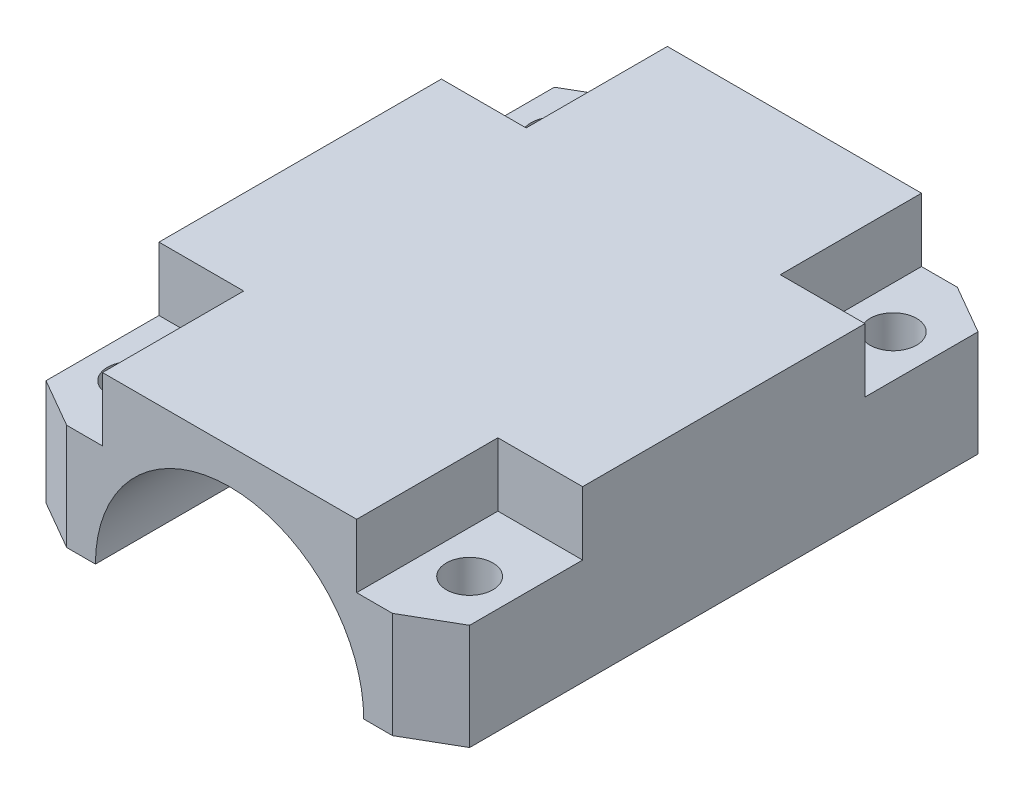
ISO-10303-21;
HEADER;
FILE_DESCRIPTION(('STEP AP214'),'2;1');
FILE_NAME('part.step','',(''),(''),'','','');
FILE_SCHEMA(('AUTOMOTIVE_DESIGN { 1 0 10303 214 1 1 1 1 }'));
ENDSEC;
DATA;
#1=APPLICATION_CONTEXT('core data for automotive mechanical design processes');
#2=APPLICATION_PROTOCOL_DEFINITION('international standard','automotive_design',2000,#1);
#3=PRODUCT_CONTEXT('',#1,'mechanical');
#4=PRODUCT('Part','Part','',(#3));
#5=PRODUCT_RELATED_PRODUCT_CATEGORY('part','',(#4));
#6=PRODUCT_DEFINITION_FORMATION('','',#4);
#7=PRODUCT_DEFINITION_CONTEXT('part definition',#1,'design');
#8=PRODUCT_DEFINITION('design','',#6,#7);
#9=PRODUCT_DEFINITION_SHAPE('','',#8);
#10=(LENGTH_UNIT() NAMED_UNIT(*) SI_UNIT(.MILLI.,.METRE.));
#11=(NAMED_UNIT(*) PLANE_ANGLE_UNIT() SI_UNIT($,.RADIAN.));
#12=(NAMED_UNIT(*) SI_UNIT($,.STERADIAN.) SOLID_ANGLE_UNIT());
#13=UNCERTAINTY_MEASURE_WITH_UNIT(LENGTH_MEASURE(1.E-05),#10,'distance_accuracy_value','');
#14=(GEOMETRIC_REPRESENTATION_CONTEXT(3) GLOBAL_UNCERTAINTY_ASSIGNED_CONTEXT((#13)) GLOBAL_UNIT_ASSIGNED_CONTEXT((#10,
#11,#12)) REPRESENTATION_CONTEXT('',''));
#15=CARTESIAN_POINT('',(0.,0.,0.));
#16=DIRECTION('',(0.,0.,1.));
#17=DIRECTION('',(1.,0.,0.));
#18=AXIS2_PLACEMENT_3D('',#15,#16,#17);
#19=CARTESIAN_POINT('',(-27.,12.,-35.));
#20=DIRECTION('',(0.,-1.,0.));
#21=DIRECTION('',(0.,0.,-1.));
#22=AXIS2_PLACEMENT_3D('',#19,#20,#21);
#23=CYLINDRICAL_SURFACE('',#22,1.65);
#24=CARTESIAN_POINT('',(-27.,0.,-35.));
#25=DIRECTION('',(0.,-1.,0.));
#26=DIRECTION('',(0.,0.,-1.));
#27=AXIS2_PLACEMENT_3D('',#24,#25,#26);
#28=CIRCLE('',#27,1.65);
#29=CARTESIAN_POINT('',(-27.,0.,-36.65));
#30=VERTEX_POINT('',#29);
#31=EDGE_CURVE('E332',#30,#30,#28,.T.);
#32=ORIENTED_EDGE('',*,*,#31,.T.);
#33=EDGE_LOOP('',(#32));
#34=FACE_BOUND('',#33,.T.);
#35=CARTESIAN_POINT('',(-27.,7.5,-35.));
#36=DIRECTION('',(0.,1.,0.));
#37=DIRECTION('',(0.,0.,1.));
#38=AXIS2_PLACEMENT_3D('',#35,#36,#37);
#39=CIRCLE('',#38,1.65);
#40=CARTESIAN_POINT('',(-27.,7.5,-33.35));
#41=VERTEX_POINT('',#40);
#42=EDGE_CURVE('E322',#41,#41,#39,.F.);
#43=ORIENTED_EDGE('',*,*,#42,.F.);
#44=EDGE_LOOP('',(#43));
#45=FACE_BOUND('',#44,.T.);
#46=ADVANCED_FACE('F32',(#34,#45),#23,.F.);
#47=CARTESIAN_POINT('',(-3.,12.,-35.));
#48=DIRECTION('',(0.,-1.,0.));
#49=DIRECTION('',(0.,0.,-1.));
#50=AXIS2_PLACEMENT_3D('',#47,#48,#49);
#51=CYLINDRICAL_SURFACE('',#50,1.65);
#52=CARTESIAN_POINT('',(-3.,0.,-35.));
#53=DIRECTION('',(0.,-1.,0.));
#54=DIRECTION('',(0.,0.,-1.));
#55=AXIS2_PLACEMENT_3D('',#52,#53,#54);
#56=CIRCLE('',#55,1.65);
#57=CARTESIAN_POINT('',(-3.,0.,-36.65));
#58=VERTEX_POINT('',#57);
#59=EDGE_CURVE('E328',#58,#58,#56,.T.);
#60=ORIENTED_EDGE('',*,*,#59,.T.);
#61=EDGE_LOOP('',(#60));
#62=FACE_BOUND('',#61,.T.);
#63=CARTESIAN_POINT('',(-3.,7.5,-35.));
#64=DIRECTION('',(0.,1.,0.));
#65=DIRECTION('',(0.,0.,1.));
#66=AXIS2_PLACEMENT_3D('',#63,#64,#65);
#67=CIRCLE('',#66,1.65);
#68=CARTESIAN_POINT('',(-3.,7.5,-33.35));
#69=VERTEX_POINT('',#68);
#70=EDGE_CURVE('E319',#69,#69,#67,.F.);
#71=ORIENTED_EDGE('',*,*,#70,.F.);
#72=EDGE_LOOP('',(#71));
#73=FACE_BOUND('',#72,.T.);
#74=ADVANCED_FACE('F447',(#62,#73),#51,.F.);
#75=CARTESIAN_POINT('',(-27.,12.,-4.99999999999997));
#76=DIRECTION('',(0.,-1.,0.));
#77=DIRECTION('',(0.,0.,-1.));
#78=AXIS2_PLACEMENT_3D('',#75,#76,#77);
#79=CYLINDRICAL_SURFACE('',#78,1.65);
#80=CARTESIAN_POINT('',(-27.,0.,-4.99999999999997));
#81=DIRECTION('',(0.,-1.,0.));
#82=DIRECTION('',(0.,0.,-1.));
#83=AXIS2_PLACEMENT_3D('',#80,#81,#82);
#84=CIRCLE('',#83,1.65);
#85=CARTESIAN_POINT('',(-27.,0.,-6.64999999999997));
#86=VERTEX_POINT('',#85);
#87=EDGE_CURVE('E329',#86,#86,#84,.T.);
#88=ORIENTED_EDGE('',*,*,#87,.T.);
#89=EDGE_LOOP('',(#88));
#90=FACE_BOUND('',#89,.T.);
#91=CARTESIAN_POINT('',(-27.,7.5,-4.99999999999997));
#92=DIRECTION('',(0.,1.,0.));
#93=DIRECTION('',(0.,0.,1.));
#94=AXIS2_PLACEMENT_3D('',#91,#92,#93);
#95=CIRCLE('',#94,1.65);
#96=CARTESIAN_POINT('',(-27.,7.5,-3.34999999999997));
#97=VERTEX_POINT('',#96);
#98=EDGE_CURVE('E316',#97,#97,#95,.F.);
#99=ORIENTED_EDGE('',*,*,#98,.F.);
#100=EDGE_LOOP('',(#99));
#101=FACE_BOUND('',#100,.T.);
#102=ADVANCED_FACE('F452',(#90,#101),#79,.F.);
#103=CARTESIAN_POINT('',(-30.,12.,-38.));
#104=DIRECTION('',(0.500000000000001,0.,0.866025403784438));
#105=DIRECTION('',(0.,-1.,0.));
#106=AXIS2_PLACEMENT_3D('',#103,#104,#105);
#107=PLANE('',#106);
#108=DIRECTION('',(0.,-1.,0.));
#109=VECTOR('',#108,1.);
#110=CARTESIAN_POINT('',(-30.,12.,-38.));
#111=LINE('',#110,#109);
#112=CARTESIAN_POINT('',(-30.,7.5,-38.));
#113=VERTEX_POINT('',#112);
#114=CARTESIAN_POINT('',(-30.,0.,-38.));
#115=VERTEX_POINT('',#114);
#116=EDGE_CURVE('E214',#113,#115,#111,.T.);
#117=ORIENTED_EDGE('',*,*,#116,.F.);
#118=DIRECTION('',(-0.866025403784438,0.,0.500000000000001));
#119=VECTOR('',#118,1.);
#120=CARTESIAN_POINT('',(-26.5358983848623,7.5,-40.));
#121=LINE('',#120,#119);
#122=CARTESIAN_POINT('',(-26.5358983848623,7.5,-40.));
#123=VERTEX_POINT('',#122);
#124=EDGE_CURVE('E363',#123,#113,#121,.T.);
#125=ORIENTED_EDGE('',*,*,#124,.F.);
#126=DIRECTION('',(0.,1.,0.));
#127=VECTOR('',#126,1.);
#128=CARTESIAN_POINT('',(-26.5358983848623,12.,-40.));
#129=LINE('',#128,#127);
#130=CARTESIAN_POINT('',(-26.5358983848623,0.,-40.));
#131=VERTEX_POINT('',#130);
#132=EDGE_CURVE('E243',#131,#123,#129,.T.);
#133=ORIENTED_EDGE('',*,*,#132,.F.);
#134=DIRECTION('',(-0.866025403784438,0.,0.500000000000001));
#135=VECTOR('',#134,1.);
#136=CARTESIAN_POINT('',(-30.,0.,-38.));
#137=LINE('',#136,#135);
#138=EDGE_CURVE('E213',#115,#131,#137,.F.);
#139=ORIENTED_EDGE('',*,*,#138,.F.);
#140=EDGE_LOOP('',(#117,#125,#133,#139));
#141=FACE_BOUND('',#140,.T.);
#142=ADVANCED_FACE('F362',(#141),#107,.F.);
#143=CARTESIAN_POINT('',(-3.46410161513775,12.,-40.));
#144=DIRECTION('',(-0.500000000000001,0.,0.866025403784438));
#145=DIRECTION('',(0.,-1.,0.));
#146=AXIS2_PLACEMENT_3D('',#143,#144,#145);
#147=PLANE('',#146);
#148=DIRECTION('',(0.,-1.,0.));
#149=VECTOR('',#148,1.);
#150=CARTESIAN_POINT('',(-3.46410161513775,12.,-40.));
#151=LINE('',#150,#149);
#152=CARTESIAN_POINT('',(-3.46410161513775,7.5,-40.));
#153=VERTEX_POINT('',#152);
#154=CARTESIAN_POINT('',(-3.46410161513775,0.,-40.));
#155=VERTEX_POINT('',#154);
#156=EDGE_CURVE('E241',#153,#155,#151,.T.);
#157=ORIENTED_EDGE('',*,*,#156,.F.);
#158=DIRECTION('',(-0.866025403784438,0.,-0.500000000000001));
#159=VECTOR('',#158,1.);
#160=CARTESIAN_POINT('',(0.,7.5,-38.));
#161=LINE('',#160,#159);
#162=CARTESIAN_POINT('',(0.,7.5,-38.));
#163=VERTEX_POINT('',#162);
#164=EDGE_CURVE('E299',#163,#153,#161,.T.);
#165=ORIENTED_EDGE('',*,*,#164,.F.);
#166=DIRECTION('',(0.,1.,0.));
#167=VECTOR('',#166,1.);
#168=CARTESIAN_POINT('',(0.,12.,-38.));
#169=LINE('',#168,#167);
#170=CARTESIAN_POINT('',(0.,0.,-38.));
#171=VERTEX_POINT('',#170);
#172=EDGE_CURVE('E252',#171,#163,#169,.T.);
#173=ORIENTED_EDGE('',*,*,#172,.F.);
#174=DIRECTION('',(-0.866025403784438,0.,-0.500000000000001));
#175=VECTOR('',#174,1.);
#176=CARTESIAN_POINT('',(-3.46410161513775,0.,-40.));
#177=LINE('',#176,#175);
#178=EDGE_CURVE('E248',#155,#171,#177,.F.);
#179=ORIENTED_EDGE('',*,*,#178,.F.);
#180=EDGE_LOOP('',(#157,#165,#173,#179));
#181=FACE_BOUND('',#180,.T.);
#182=ADVANCED_FACE('F428',(#181),#147,.F.);
#183=CARTESIAN_POINT('',(-26.5358983848623,12.,0.));
#184=DIRECTION('',(0.5,0.,-0.866025403784438));
#185=DIRECTION('',(0.,-1.,0.));
#186=AXIS2_PLACEMENT_3D('',#183,#184,#185);
#187=PLANE('',#186);
#188=DIRECTION('',(0.,-1.,0.));
#189=VECTOR('',#188,1.);
#190=CARTESIAN_POINT('',(-26.5358983848623,12.,0.));
#191=LINE('',#190,#189);
#192=CARTESIAN_POINT('',(-26.5358983848623,7.5,0.));
#193=VERTEX_POINT('',#192);
#194=CARTESIAN_POINT('',(-26.5358983848623,0.,0.));
#195=VERTEX_POINT('',#194);
#196=EDGE_CURVE('E11',#193,#195,#191,.T.);
#197=ORIENTED_EDGE('',*,*,#196,.F.);
#198=DIRECTION('',(0.866025403784438,0.,0.5));
#199=VECTOR('',#198,1.);
#200=CARTESIAN_POINT('',(-30.,7.5,-1.99999999999999));
#201=LINE('',#200,#199);
#202=CARTESIAN_POINT('',(-30.,7.5,-1.99999999999999));
#203=VERTEX_POINT('',#202);
#204=EDGE_CURVE('E182',#203,#193,#201,.T.);
#205=ORIENTED_EDGE('',*,*,#204,.F.);
#206=DIRECTION('',(0.,1.,0.));
#207=VECTOR('',#206,1.);
#208=CARTESIAN_POINT('',(-30.,12.,-1.99999999999999));
#209=LINE('',#208,#207);
#210=CARTESIAN_POINT('',(-30.,0.,-1.99999999999999));
#211=VERTEX_POINT('',#210);
#212=EDGE_CURVE('E209',#211,#203,#209,.T.);
#213=ORIENTED_EDGE('',*,*,#212,.F.);
#214=DIRECTION('',(0.866025403784439,0.,0.5));
#215=VECTOR('',#214,1.);
#216=CARTESIAN_POINT('',(-26.5358983848623,0.,0.));
#217=LINE('',#216,#215);
#218=EDGE_CURVE('E207',#195,#211,#217,.F.);
#219=ORIENTED_EDGE('',*,*,#218,.F.);
#220=EDGE_LOOP('',(#197,#205,#213,#219));
#221=FACE_BOUND('',#220,.T.);
#222=ADVANCED_FACE('F206',(#221),#187,.F.);
#223=CARTESIAN_POINT('',(0.,0.,0.));
#224=DIRECTION('',(0.,1.,0.));
#225=DIRECTION('',(0.,0.,1.));
#226=AXIS2_PLACEMENT_3D('',#223,#224,#225);
#227=PLANE('',#226);
#228=ORIENTED_EDGE('',*,*,#59,.F.);
#229=EDGE_LOOP('',(#228));
#230=FACE_BOUND('',#229,.T.);
#231=CARTESIAN_POINT('',(-3.,0.,-4.99999999999997));
#232=DIRECTION('',(0.,-1.,0.));
#233=DIRECTION('',(0.,0.,-1.));
#234=AXIS2_PLACEMENT_3D('',#231,#232,#233);
#235=CIRCLE('',#234,1.65);
#236=CARTESIAN_POINT('',(-3.,0.,-6.64999999999997));
#237=VERTEX_POINT('',#236);
#238=EDGE_CURVE('E325',#237,#237,#235,.T.);
#239=ORIENTED_EDGE('',*,*,#238,.F.);
#240=EDGE_LOOP('',(#239));
#241=FACE_BOUND('',#240,.T.);
#242=DIRECTION('',(-1.,0.,0.));
#243=VECTOR('',#242,1.);
#244=CARTESIAN_POINT('',(0.,0.,-40.));
#245=LINE('',#244,#243);
#246=CARTESIAN_POINT('',(-5.5,0.,-40.));
#247=VERTEX_POINT('',#246);
#248=EDGE_CURVE('E352',#155,#247,#245,.T.);
#249=ORIENTED_EDGE('',*,*,#248,.F.);
#250=ORIENTED_EDGE('',*,*,#178,.T.);
#251=DIRECTION('',(0.,0.,-1.));
#252=VECTOR('',#251,1.);
#253=CARTESIAN_POINT('',(0.,0.,0.));
#254=LINE('',#253,#252);
#255=CARTESIAN_POINT('',(0.,0.,-2.));
#256=VERTEX_POINT('',#255);
#257=EDGE_CURVE('E341',#256,#171,#254,.T.);
#258=ORIENTED_EDGE('',*,*,#257,.F.);
#259=DIRECTION('',(0.866025403784438,0.,-0.500000000000001));
#260=VECTOR('',#259,1.);
#261=CARTESIAN_POINT('',(0.,0.,-2.));
#262=LINE('',#261,#260);
#263=CARTESIAN_POINT('',(-3.46410161513775,0.,0.));
#264=VERTEX_POINT('',#263);
#265=EDGE_CURVE('E246',#256,#264,#262,.F.);
#266=ORIENTED_EDGE('',*,*,#265,.T.);
#267=DIRECTION('',(1.,0.,0.));
#268=VECTOR('',#267,1.);
#269=CARTESIAN_POINT('',(0.,0.,0.));
#270=LINE('',#269,#268);
#271=CARTESIAN_POINT('',(-5.5,0.,0.));
#272=VERTEX_POINT('',#271);
#273=EDGE_CURVE('E224',#272,#264,#270,.T.);
#274=ORIENTED_EDGE('',*,*,#273,.F.);
#275=DIRECTION('',(0.,0.,-1.));
#276=VECTOR('',#275,1.);
#277=CARTESIAN_POINT('',(-5.5,0.,-40.));
#278=LINE('',#277,#276);
#279=EDGE_CURVE('E235',#247,#272,#278,.F.);
#280=ORIENTED_EDGE('',*,*,#279,.F.);
#281=EDGE_LOOP('',(#249,#250,#258,#266,#274,#280));
#282=FACE_BOUND('',#281,.T.);
#283=ADVANCED_FACE('F432',(#230,#241,#282),#227,.F.);
#284=ORIENTED_EDGE('',*,*,#87,.F.);
#285=EDGE_LOOP('',(#284));
#286=FACE_BOUND('',#285,.T.);
#287=ORIENTED_EDGE('',*,*,#31,.F.);
#288=EDGE_LOOP('',(#287));
#289=FACE_BOUND('',#288,.T.);
#290=DIRECTION('',(0.,0.,1.));
#291=VECTOR('',#290,1.);
#292=CARTESIAN_POINT('',(-30.,0.,0.));
#293=LINE('',#292,#291);
#294=EDGE_CURVE('E230',#115,#211,#293,.T.);
#295=ORIENTED_EDGE('',*,*,#294,.F.);
#296=ORIENTED_EDGE('',*,*,#138,.T.);
#297=CARTESIAN_POINT('',(-24.5,0.,-40.));
#298=VERTEX_POINT('',#297);
#299=EDGE_CURVE('E351',#298,#131,#245,.T.);
#300=ORIENTED_EDGE('',*,*,#299,.F.);
#301=DIRECTION('',(0.,0.,-1.));
#302=VECTOR('',#301,1.);
#303=CARTESIAN_POINT('',(-24.5,0.,-40.));
#304=LINE('',#303,#302);
#305=CARTESIAN_POINT('',(-24.5,0.,0.));
#306=VERTEX_POINT('',#305);
#307=EDGE_CURVE('E220',#306,#298,#304,.T.);
#308=ORIENTED_EDGE('',*,*,#307,.F.);
#309=EDGE_CURVE('E217',#195,#306,#270,.T.);
#310=ORIENTED_EDGE('',*,*,#309,.F.);
#311=ORIENTED_EDGE('',*,*,#218,.T.);
#312=EDGE_LOOP('',(#295,#296,#300,#308,#310,#311));
#313=FACE_BOUND('',#312,.T.);
#314=ADVANCED_FACE('F218',(#286,#289,#313),#227,.F.);
#315=CARTESIAN_POINT('',(0.,12.,0.));
#316=DIRECTION('',(-1.,0.,0.));
#317=DIRECTION('',(0.,0.,1.));
#318=AXIS2_PLACEMENT_3D('',#315,#316,#317);
#319=PLANE('',#318);
#320=DIRECTION('',(0.,0.,-1.));
#321=VECTOR('',#320,1.);
#322=CARTESIAN_POINT('',(0.,12.,0.));
#323=LINE('',#322,#321);
#324=CARTESIAN_POINT('',(0.,12.,-10.));
#325=VERTEX_POINT('',#324);
#326=CARTESIAN_POINT('',(0.,12.,-30.));
#327=VERTEX_POINT('',#326);
#328=EDGE_CURVE('E223',#325,#327,#323,.T.);
#329=ORIENTED_EDGE('',*,*,#328,.F.);
#330=DIRECTION('',(0.,1.,0.));
#331=VECTOR('',#330,1.);
#332=CARTESIAN_POINT('',(0.,7.5,-10.));
#333=LINE('',#332,#331);
#334=CARTESIAN_POINT('',(0.,7.5,-10.));
#335=VERTEX_POINT('',#334);
#336=EDGE_CURVE('E283',#335,#325,#333,.T.);
#337=ORIENTED_EDGE('',*,*,#336,.F.);
#338=DIRECTION('',(0.,0.,-1.));
#339=VECTOR('',#338,1.);
#340=CARTESIAN_POINT('',(0.,7.5,-10.));
#341=LINE('',#340,#339);
#342=CARTESIAN_POINT('',(0.,7.5,-2.));
#343=VERTEX_POINT('',#342);
#344=EDGE_CURVE('E268',#343,#335,#341,.T.);
#345=ORIENTED_EDGE('',*,*,#344,.F.);
#346=DIRECTION('',(0.,-1.,0.));
#347=VECTOR('',#346,1.);
#348=CARTESIAN_POINT('',(0.,12.,-2.));
#349=LINE('',#348,#347);
#350=EDGE_CURVE('E250',#343,#256,#349,.T.);
#351=ORIENTED_EDGE('',*,*,#350,.T.);
#352=ORIENTED_EDGE('',*,*,#257,.T.);
#353=ORIENTED_EDGE('',*,*,#172,.T.);
#354=DIRECTION('',(0.,0.,-1.));
#355=VECTOR('',#354,1.);
#356=CARTESIAN_POINT('',(0.,7.5,-30.));
#357=LINE('',#356,#355);
#358=CARTESIAN_POINT('',(0.,7.5,-30.));
#359=VERTEX_POINT('',#358);
#360=EDGE_CURVE('E55',#359,#163,#357,.T.);
#361=ORIENTED_EDGE('',*,*,#360,.F.);
#362=DIRECTION('',(0.,1.,0.));
#363=VECTOR('',#362,1.);
#364=CARTESIAN_POINT('',(0.,7.5,-30.));
#365=LINE('',#364,#363);
#366=EDGE_CURVE('E307',#359,#327,#365,.T.);
#367=ORIENTED_EDGE('',*,*,#366,.T.);
#368=EDGE_LOOP('',(#329,#337,#345,#351,#352,#353,#361,#367));
#369=FACE_BOUND('',#368,.T.);
#370=ADVANCED_FACE('F629',(#369),#319,.F.);
#371=CARTESIAN_POINT('',(0.,12.,-40.));
#372=DIRECTION('',(0.,0.,1.));
#373=DIRECTION('',(1.,0.,0.));
#374=AXIS2_PLACEMENT_3D('',#371,#372,#373);
#375=PLANE('',#374);
#376=DIRECTION('',(-1.,0.,0.));
#377=VECTOR('',#376,1.);
#378=CARTESIAN_POINT('',(-24.,7.5,-40.));
#379=LINE('',#378,#377);
#380=CARTESIAN_POINT('',(-24.,7.5,-40.));
#381=VERTEX_POINT('',#380);
#382=EDGE_CURVE('E47',#381,#123,#379,.T.);
#383=ORIENTED_EDGE('',*,*,#382,.F.);
#384=DIRECTION('',(0.,1.,0.));
#385=VECTOR('',#384,1.);
#386=CARTESIAN_POINT('',(-24.,7.5,-40.));
#387=LINE('',#386,#385);
#388=CARTESIAN_POINT('',(-24.,12.,-40.));
#389=VERTEX_POINT('',#388);
#390=EDGE_CURVE('E375',#381,#389,#387,.T.);
#391=ORIENTED_EDGE('',*,*,#390,.T.);
#392=DIRECTION('',(-1.,0.,0.));
#393=VECTOR('',#392,1.);
#394=CARTESIAN_POINT('',(0.,12.,-40.));
#395=LINE('',#394,#393);
#396=CARTESIAN_POINT('',(-6.,12.,-40.));
#397=VERTEX_POINT('',#396);
#398=EDGE_CURVE('E227',#397,#389,#395,.T.);
#399=ORIENTED_EDGE('',*,*,#398,.F.);
#400=DIRECTION('',(0.,1.,0.));
#401=VECTOR('',#400,1.);
#402=CARTESIAN_POINT('',(-6.,7.5,-40.));
#403=LINE('',#402,#401);
#404=CARTESIAN_POINT('',(-6.,7.5,-40.));
#405=VERTEX_POINT('',#404);
#406=EDGE_CURVE('E301',#405,#397,#403,.T.);
#407=ORIENTED_EDGE('',*,*,#406,.F.);
#408=DIRECTION('',(-1.,0.,0.));
#409=VECTOR('',#408,1.);
#410=CARTESIAN_POINT('',(-3.46410161513775,7.5,-40.));
#411=LINE('',#410,#409);
#412=EDGE_CURVE('E289',#153,#405,#411,.T.);
#413=ORIENTED_EDGE('',*,*,#412,.F.);
#414=ORIENTED_EDGE('',*,*,#156,.T.);
#415=ORIENTED_EDGE('',*,*,#248,.T.);
#416=CARTESIAN_POINT('',(-15.,0.,-40.));
#417=DIRECTION('',(0.,0.,-1.));
#418=DIRECTION('',(-1.,0.,0.));
#419=AXIS2_PLACEMENT_3D('',#416,#417,#418);
#420=CIRCLE('',#419,9.5);
#421=EDGE_CURVE('E337',#298,#247,#420,.T.);
#422=ORIENTED_EDGE('',*,*,#421,.F.);
#423=ORIENTED_EDGE('',*,*,#299,.T.);
#424=ORIENTED_EDGE('',*,*,#132,.T.);
#425=EDGE_LOOP('',(#383,#391,#399,#407,#413,#414,#415,#422,#423,#424));
#426=FACE_BOUND('',#425,.T.);
#427=ADVANCED_FACE('F358',(#426),#375,.F.);
#428=CARTESIAN_POINT('',(-30.,12.,0.));
#429=DIRECTION('',(1.,0.,0.));
#430=DIRECTION('',(0.,0.,-1.));
#431=AXIS2_PLACEMENT_3D('',#428,#429,#430);
#432=PLANE('',#431);
#433=DIRECTION('',(0.,0.,1.));
#434=VECTOR('',#433,1.);
#435=CARTESIAN_POINT('',(-30.,12.,0.));
#436=LINE('',#435,#434);
#437=CARTESIAN_POINT('',(-30.,12.,-30.));
#438=VERTEX_POINT('',#437);
#439=CARTESIAN_POINT('',(-30.,12.,-10.));
#440=VERTEX_POINT('',#439);
#441=EDGE_CURVE('E345',#438,#440,#436,.T.);
#442=ORIENTED_EDGE('',*,*,#441,.F.);
#443=DIRECTION('',(0.,1.,0.));
#444=VECTOR('',#443,1.);
#445=CARTESIAN_POINT('',(-30.,7.5,-30.));
#446=LINE('',#445,#444);
#447=CARTESIAN_POINT('',(-30.,7.5,-30.));
#448=VERTEX_POINT('',#447);
#449=EDGE_CURVE('E381',#448,#438,#446,.T.);
#450=ORIENTED_EDGE('',*,*,#449,.F.);
#451=DIRECTION('',(0.,0.,1.));
#452=VECTOR('',#451,1.);
#453=CARTESIAN_POINT('',(-30.,7.5,-38.));
#454=LINE('',#453,#452);
#455=EDGE_CURVE('E365',#113,#448,#454,.T.);
#456=ORIENTED_EDGE('',*,*,#455,.F.);
#457=ORIENTED_EDGE('',*,*,#116,.T.);
#458=ORIENTED_EDGE('',*,*,#294,.T.);
#459=ORIENTED_EDGE('',*,*,#212,.T.);
#460=DIRECTION('',(0.,0.,1.));
#461=VECTOR('',#460,1.);
#462=CARTESIAN_POINT('',(-30.,7.5,-10.));
#463=LINE('',#462,#461);
#464=CARTESIAN_POINT('',(-30.,7.5,-10.));
#465=VERTEX_POINT('',#464);
#466=EDGE_CURVE('E191',#465,#203,#463,.T.);
#467=ORIENTED_EDGE('',*,*,#466,.F.);
#468=DIRECTION('',(0.,1.,0.));
#469=VECTOR('',#468,1.);
#470=CARTESIAN_POINT('',(-30.,7.5,-10.));
#471=LINE('',#470,#469);
#472=EDGE_CURVE('E280',#465,#440,#471,.T.);
#473=ORIENTED_EDGE('',*,*,#472,.T.);
#474=EDGE_LOOP('',(#442,#450,#456,#457,#458,#459,#467,#473));
#475=FACE_BOUND('',#474,.T.);
#476=ADVANCED_FACE('F641',(#475),#432,.F.);
#477=CARTESIAN_POINT('',(0.,12.,0.));
#478=DIRECTION('',(0.,0.,-1.));
#479=DIRECTION('',(-1.,0.,0.));
#480=AXIS2_PLACEMENT_3D('',#477,#478,#479);
#481=PLANE('',#480);
#482=DIRECTION('',(1.,0.,0.));
#483=VECTOR('',#482,1.);
#484=CARTESIAN_POINT('',(-3.46410161513775,7.5,0.));
#485=LINE('',#484,#483);
#486=CARTESIAN_POINT('',(-6.,7.5,0.));
#487=VERTEX_POINT('',#486);
#488=CARTESIAN_POINT('',(-3.46410161513775,7.5,0.));
#489=VERTEX_POINT('',#488);
#490=EDGE_CURVE('E257',#487,#489,#485,.T.);
#491=ORIENTED_EDGE('',*,*,#490,.F.);
#492=DIRECTION('',(0.,1.,0.));
#493=VECTOR('',#492,1.);
#494=CARTESIAN_POINT('',(-6.,7.5,0.));
#495=LINE('',#494,#493);
#496=CARTESIAN_POINT('',(-6.,12.,0.));
#497=VERTEX_POINT('',#496);
#498=EDGE_CURVE('E286',#487,#497,#495,.T.);
#499=ORIENTED_EDGE('',*,*,#498,.T.);
#500=DIRECTION('',(1.,0.,0.));
#501=VECTOR('',#500,1.);
#502=CARTESIAN_POINT('',(0.,12.,0.));
#503=LINE('',#502,#501);
#504=CARTESIAN_POINT('',(-24.,12.,0.));
#505=VERTEX_POINT('',#504);
#506=EDGE_CURVE('E236',#505,#497,#503,.T.);
#507=ORIENTED_EDGE('',*,*,#506,.F.);
#508=DIRECTION('',(0.,1.,0.));
#509=VECTOR('',#508,1.);
#510=CARTESIAN_POINT('',(-24.,7.5,0.));
#511=LINE('',#510,#509);
#512=CARTESIAN_POINT('',(-24.,7.5,0.));
#513=VERTEX_POINT('',#512);
#514=EDGE_CURVE('E203',#513,#505,#511,.T.);
#515=ORIENTED_EDGE('',*,*,#514,.F.);
#516=DIRECTION('',(1.,0.,0.));
#517=VECTOR('',#516,1.);
#518=CARTESIAN_POINT('',(-26.5358983848623,7.5,0.));
#519=LINE('',#518,#517);
#520=EDGE_CURVE('E187',#193,#513,#519,.T.);
#521=ORIENTED_EDGE('',*,*,#520,.F.);
#522=ORIENTED_EDGE('',*,*,#196,.T.);
#523=ORIENTED_EDGE('',*,*,#309,.T.);
#524=CARTESIAN_POINT('',(-15.,0.,0.));
#525=DIRECTION('',(0.,0.,-1.));
#526=DIRECTION('',(-1.,0.,0.));
#527=AXIS2_PLACEMENT_3D('',#524,#525,#526);
#528=CIRCLE('',#527,9.5);
#529=EDGE_CURVE('E340',#306,#272,#528,.T.);
#530=ORIENTED_EDGE('',*,*,#529,.T.);
#531=ORIENTED_EDGE('',*,*,#273,.T.);
#532=DIRECTION('',(0.,1.,0.));
#533=VECTOR('',#532,1.);
#534=CARTESIAN_POINT('',(-3.46410161513775,12.,0.));
#535=LINE('',#534,#533);
#536=EDGE_CURVE('E40',#264,#489,#535,.T.);
#537=ORIENTED_EDGE('',*,*,#536,.T.);
#538=EDGE_LOOP('',(#491,#499,#507,#515,#521,#522,#523,#530,#531,#537));
#539=FACE_BOUND('',#538,.T.);
#540=ADVANCED_FACE('F200',(#539),#481,.F.);
#541=CARTESIAN_POINT('',(0.,12.,0.));
#542=DIRECTION('',(0.,1.,0.));
#543=DIRECTION('',(0.,0.,1.));
#544=AXIS2_PLACEMENT_3D('',#541,#542,#543);
#545=PLANE('',#544);
#546=DIRECTION('',(0.,0.,-1.));
#547=VECTOR('',#546,1.);
#548=CARTESIAN_POINT('',(-24.,12.,-30.));
#549=LINE('',#548,#547);
#550=CARTESIAN_POINT('',(-24.,12.,-30.));
#551=VERTEX_POINT('',#550);
#552=EDGE_CURVE('E285',#551,#389,#549,.T.);
#553=ORIENTED_EDGE('',*,*,#552,.F.);
#554=DIRECTION('',(1.,0.,0.));
#555=VECTOR('',#554,1.);
#556=CARTESIAN_POINT('',(-30.,12.,-30.));
#557=LINE('',#556,#555);
#558=EDGE_CURVE('E377',#438,#551,#557,.T.);
#559=ORIENTED_EDGE('',*,*,#558,.F.);
#560=ORIENTED_EDGE('',*,*,#441,.T.);
#561=DIRECTION('',(-1.,0.,0.));
#562=VECTOR('',#561,1.);
#563=CARTESIAN_POINT('',(-24.,12.,-10.));
#564=LINE('',#563,#562);
#565=CARTESIAN_POINT('',(-24.,12.,-10.));
#566=VERTEX_POINT('',#565);
#567=EDGE_CURVE('E196',#566,#440,#564,.T.);
#568=ORIENTED_EDGE('',*,*,#567,.F.);
#569=DIRECTION('',(0.,0.,-1.));
#570=VECTOR('',#569,1.);
#571=CARTESIAN_POINT('',(-24.,12.,0.));
#572=LINE('',#571,#570);
#573=EDGE_CURVE('E400',#505,#566,#572,.T.);
#574=ORIENTED_EDGE('',*,*,#573,.F.);
#575=ORIENTED_EDGE('',*,*,#506,.T.);
#576=DIRECTION('',(0.,0.,1.));
#577=VECTOR('',#576,1.);
#578=CARTESIAN_POINT('',(-6.,12.,0.));
#579=LINE('',#578,#577);
#580=CARTESIAN_POINT('',(-6.,12.,-10.));
#581=VERTEX_POINT('',#580);
#582=EDGE_CURVE('E279',#581,#497,#579,.T.);
#583=ORIENTED_EDGE('',*,*,#582,.F.);
#584=DIRECTION('',(-1.,0.,0.));
#585=VECTOR('',#584,1.);
#586=CARTESIAN_POINT('',(-6.,12.,-10.));
#587=LINE('',#586,#585);
#588=EDGE_CURVE('E276',#325,#581,#587,.T.);
#589=ORIENTED_EDGE('',*,*,#588,.F.);
#590=ORIENTED_EDGE('',*,*,#328,.T.);
#591=DIRECTION('',(1.,0.,0.));
#592=VECTOR('',#591,1.);
#593=CARTESIAN_POINT('',(-6.,12.,-30.));
#594=LINE('',#593,#592);
#595=CARTESIAN_POINT('',(-6.,12.,-30.));
#596=VERTEX_POINT('',#595);
#597=EDGE_CURVE('E293',#596,#327,#594,.T.);
#598=ORIENTED_EDGE('',*,*,#597,.F.);
#599=DIRECTION('',(0.,0.,1.));
#600=VECTOR('',#599,1.);
#601=CARTESIAN_POINT('',(-6.,12.,-40.));
#602=LINE('',#601,#600);
#603=EDGE_CURVE('E302',#397,#596,#602,.T.);
#604=ORIENTED_EDGE('',*,*,#603,.F.);
#605=ORIENTED_EDGE('',*,*,#398,.T.);
#606=EDGE_LOOP('',(#553,#559,#560,#568,#574,#575,#583,#589,#590,#598,#604,#605));
#607=FACE_BOUND('',#606,.T.);
#608=ADVANCED_FACE('F396',(#607),#545,.T.);
#609=CARTESIAN_POINT('',(-15.,0.,-40.));
#610=DIRECTION('',(0.,0.,-1.));
#611=DIRECTION('',(-1.,0.,0.));
#612=AXIS2_PLACEMENT_3D('',#609,#610,#611);
#613=CYLINDRICAL_SURFACE('',#612,9.5);
#614=ORIENTED_EDGE('',*,*,#279,.T.);
#615=ORIENTED_EDGE('',*,*,#529,.F.);
#616=ORIENTED_EDGE('',*,*,#307,.T.);
#617=ORIENTED_EDGE('',*,*,#421,.T.);
#618=EDGE_LOOP('',(#614,#615,#616,#617));
#619=FACE_BOUND('',#618,.T.);
#620=ADVANCED_FACE('F434',(#619),#613,.F.);
#621=CARTESIAN_POINT('',(-3.,12.,-4.99999999999997));
#622=DIRECTION('',(0.,-1.,0.));
#623=DIRECTION('',(0.,0.,-1.));
#624=AXIS2_PLACEMENT_3D('',#621,#622,#623);
#625=CYLINDRICAL_SURFACE('',#624,1.65);
#626=CARTESIAN_POINT('',(-3.,7.5,-4.99999999999997));
#627=DIRECTION('',(0.,-1.,0.));
#628=DIRECTION('',(0.,0.,-1.));
#629=AXIS2_PLACEMENT_3D('',#626,#627,#628);
#630=CIRCLE('',#629,1.65);
#631=CARTESIAN_POINT('',(-3.,7.5,-6.64999999999997));
#632=VERTEX_POINT('',#631);
#633=EDGE_CURVE('E310',#632,#632,#630,.F.);
#634=ORIENTED_EDGE('',*,*,#633,.T.);
#635=EDGE_LOOP('',(#634));
#636=FACE_BOUND('',#635,.T.);
#637=ORIENTED_EDGE('',*,*,#238,.T.);
#638=EDGE_LOOP('',(#637));
#639=FACE_BOUND('',#638,.T.);
#640=ADVANCED_FACE('F436',(#636,#639),#625,.F.);
#641=CARTESIAN_POINT('',(0.,12.,-2.));
#642=DIRECTION('',(-0.500000000000001,0.,-0.866025403784438));
#643=DIRECTION('',(0.,-1.,0.));
#644=AXIS2_PLACEMENT_3D('',#641,#642,#643);
#645=PLANE('',#644);
#646=DIRECTION('',(0.866025403784438,0.,-0.500000000000001));
#647=VECTOR('',#646,1.);
#648=CARTESIAN_POINT('',(0.,7.5,-2.));
#649=LINE('',#648,#647);
#650=EDGE_CURVE('E264',#489,#343,#649,.T.);
#651=ORIENTED_EDGE('',*,*,#650,.F.);
#652=ORIENTED_EDGE('',*,*,#536,.F.);
#653=ORIENTED_EDGE('',*,*,#265,.F.);
#654=ORIENTED_EDGE('',*,*,#350,.F.);
#655=EDGE_LOOP('',(#651,#652,#653,#654));
#656=FACE_BOUND('',#655,.T.);
#657=ADVANCED_FACE('F34',(#656),#645,.F.);
#658=CARTESIAN_POINT('',(0.,7.5,0.));
#659=DIRECTION('',(0.,-1.,0.));
#660=DIRECTION('',(0.,0.,-1.));
#661=AXIS2_PLACEMENT_3D('',#658,#659,#660);
#662=PLANE('',#661);
#663=DIRECTION('',(-1.,0.,0.));
#664=VECTOR('',#663,1.);
#665=CARTESIAN_POINT('',(-6.,7.5,-10.));
#666=LINE('',#665,#664);
#667=CARTESIAN_POINT('',(-6.,7.5,-10.));
#668=VERTEX_POINT('',#667);
#669=EDGE_CURVE('E282',#335,#668,#666,.T.);
#670=ORIENTED_EDGE('',*,*,#669,.T.);
#671=DIRECTION('',(0.,0.,1.));
#672=VECTOR('',#671,1.);
#673=CARTESIAN_POINT('',(-6.,7.5,0.));
#674=LINE('',#673,#672);
#675=EDGE_CURVE('E272',#668,#487,#674,.T.);
#676=ORIENTED_EDGE('',*,*,#675,.T.);
#677=ORIENTED_EDGE('',*,*,#490,.T.);
#678=ORIENTED_EDGE('',*,*,#650,.T.);
#679=ORIENTED_EDGE('',*,*,#344,.T.);
#680=EDGE_LOOP('',(#670,#676,#677,#678,#679));
#681=FACE_BOUND('',#680,.T.);
#682=ORIENTED_EDGE('',*,*,#633,.F.);
#683=EDGE_LOOP('',(#682));
#684=FACE_BOUND('',#683,.T.);
#685=ADVANCED_FACE('F388',(#681,#684),#662,.F.);
#686=CARTESIAN_POINT('',(-6.,7.5,-10.));
#687=DIRECTION('',(0.,0.,-1.));
#688=DIRECTION('',(-1.,0.,0.));
#689=AXIS2_PLACEMENT_3D('',#686,#687,#688);
#690=PLANE('',#689);
#691=ORIENTED_EDGE('',*,*,#588,.T.);
#692=DIRECTION('',(0.,1.,0.));
#693=VECTOR('',#692,1.);
#694=CARTESIAN_POINT('',(-6.,7.5,-10.));
#695=LINE('',#694,#693);
#696=EDGE_CURVE('E270',#668,#581,#695,.T.);
#697=ORIENTED_EDGE('',*,*,#696,.F.);
#698=ORIENTED_EDGE('',*,*,#669,.F.);
#699=ORIENTED_EDGE('',*,*,#336,.T.);
#700=EDGE_LOOP('',(#691,#697,#698,#699));
#701=FACE_BOUND('',#700,.T.);
#702=ADVANCED_FACE('F470',(#701),#690,.F.);
#703=CARTESIAN_POINT('',(-6.,7.5,0.));
#704=DIRECTION('',(-1.,0.,0.));
#705=DIRECTION('',(0.,0.,1.));
#706=AXIS2_PLACEMENT_3D('',#703,#704,#705);
#707=PLANE('',#706);
#708=ORIENTED_EDGE('',*,*,#582,.T.);
#709=ORIENTED_EDGE('',*,*,#498,.F.);
#710=ORIENTED_EDGE('',*,*,#675,.F.);
#711=ORIENTED_EDGE('',*,*,#696,.T.);
#712=EDGE_LOOP('',(#708,#709,#710,#711));
#713=FACE_BOUND('',#712,.T.);
#714=ADVANCED_FACE('F391',(#713),#707,.F.);
#715=CARTESIAN_POINT('',(0.,7.5,0.));
#716=DIRECTION('',(0.,1.,0.));
#717=DIRECTION('',(0.,0.,1.));
#718=AXIS2_PLACEMENT_3D('',#715,#716,#717);
#719=PLANE('',#718);
#720=ORIENTED_EDGE('',*,*,#204,.T.);
#721=ORIENTED_EDGE('',*,*,#520,.T.);
#722=DIRECTION('',(0.,0.,-1.));
#723=VECTOR('',#722,1.);
#724=CARTESIAN_POINT('',(-24.,7.5,0.));
#725=LINE('',#724,#723);
#726=CARTESIAN_POINT('',(-24.,7.5,-10.));
#727=VERTEX_POINT('',#726);
#728=EDGE_CURVE('E204',#513,#727,#725,.T.);
#729=ORIENTED_EDGE('',*,*,#728,.T.);
#730=DIRECTION('',(-1.,0.,0.));
#731=VECTOR('',#730,1.);
#732=CARTESIAN_POINT('',(-24.,7.5,-10.));
#733=LINE('',#732,#731);
#734=EDGE_CURVE('E685',#727,#465,#733,.T.);
#735=ORIENTED_EDGE('',*,*,#734,.T.);
#736=ORIENTED_EDGE('',*,*,#466,.T.);
#737=EDGE_LOOP('',(#720,#721,#729,#735,#736));
#738=FACE_BOUND('',#737,.T.);
#739=ORIENTED_EDGE('',*,*,#98,.T.);
#740=EDGE_LOOP('',(#739));
#741=FACE_BOUND('',#740,.T.);
#742=ADVANCED_FACE('F184',(#738,#741),#719,.T.);
#743=CARTESIAN_POINT('',(-24.,7.5,-10.));
#744=DIRECTION('',(0.,0.,-1.));
#745=DIRECTION('',(-1.,0.,0.));
#746=AXIS2_PLACEMENT_3D('',#743,#744,#745);
#747=PLANE('',#746);
#748=ORIENTED_EDGE('',*,*,#567,.T.);
#749=ORIENTED_EDGE('',*,*,#472,.F.);
#750=ORIENTED_EDGE('',*,*,#734,.F.);
#751=DIRECTION('',(0.,1.,0.));
#752=VECTOR('',#751,1.);
#753=CARTESIAN_POINT('',(-24.,7.5,-10.));
#754=LINE('',#753,#752);
#755=EDGE_CURVE('E409',#727,#566,#754,.T.);
#756=ORIENTED_EDGE('',*,*,#755,.T.);
#757=EDGE_LOOP('',(#748,#749,#750,#756));
#758=FACE_BOUND('',#757,.T.);
#759=ADVANCED_FACE('F489',(#758),#747,.F.);
#760=CARTESIAN_POINT('',(-24.,7.5,0.));
#761=DIRECTION('',(1.,0.,0.));
#762=DIRECTION('',(0.,0.,-1.));
#763=AXIS2_PLACEMENT_3D('',#760,#761,#762);
#764=PLANE('',#763);
#765=ORIENTED_EDGE('',*,*,#573,.T.);
#766=ORIENTED_EDGE('',*,*,#755,.F.);
#767=ORIENTED_EDGE('',*,*,#728,.F.);
#768=ORIENTED_EDGE('',*,*,#514,.T.);
#769=EDGE_LOOP('',(#765,#766,#767,#768));
#770=FACE_BOUND('',#769,.T.);
#771=ADVANCED_FACE('F469',(#770),#764,.F.);
#772=CARTESIAN_POINT('',(0.,7.5,0.));
#773=DIRECTION('',(0.,1.,0.));
#774=DIRECTION('',(0.,0.,1.));
#775=AXIS2_PLACEMENT_3D('',#772,#773,#774);
#776=PLANE('',#775);
#777=ORIENTED_EDGE('',*,*,#412,.T.);
#778=DIRECTION('',(0.,0.,1.));
#779=VECTOR('',#778,1.);
#780=CARTESIAN_POINT('',(-6.,7.5,-40.));
#781=LINE('',#780,#779);
#782=CARTESIAN_POINT('',(-6.,7.5,-30.));
#783=VERTEX_POINT('',#782);
#784=EDGE_CURVE('E292',#405,#783,#781,.T.);
#785=ORIENTED_EDGE('',*,*,#784,.T.);
#786=DIRECTION('',(1.,0.,0.));
#787=VECTOR('',#786,1.);
#788=CARTESIAN_POINT('',(-6.,7.5,-30.));
#789=LINE('',#788,#787);
#790=EDGE_CURVE('E296',#783,#359,#789,.T.);
#791=ORIENTED_EDGE('',*,*,#790,.T.);
#792=ORIENTED_EDGE('',*,*,#360,.T.);
#793=ORIENTED_EDGE('',*,*,#164,.T.);
#794=EDGE_LOOP('',(#777,#785,#791,#792,#793));
#795=FACE_BOUND('',#794,.T.);
#796=ORIENTED_EDGE('',*,*,#70,.T.);
#797=EDGE_LOOP('',(#796));
#798=FACE_BOUND('',#797,.T.);
#799=ADVANCED_FACE('F465',(#795,#798),#776,.T.);
#800=CARTESIAN_POINT('',(-6.,7.5,-30.));
#801=DIRECTION('',(0.,0.,1.));
#802=DIRECTION('',(1.,0.,0.));
#803=AXIS2_PLACEMENT_3D('',#800,#801,#802);
#804=PLANE('',#803);
#805=ORIENTED_EDGE('',*,*,#597,.T.);
#806=ORIENTED_EDGE('',*,*,#366,.F.);
#807=ORIENTED_EDGE('',*,*,#790,.F.);
#808=DIRECTION('',(0.,1.,0.));
#809=VECTOR('',#808,1.);
#810=CARTESIAN_POINT('',(-6.,7.5,-30.));
#811=LINE('',#810,#809);
#812=EDGE_CURVE('E311',#783,#596,#811,.T.);
#813=ORIENTED_EDGE('',*,*,#812,.T.);
#814=EDGE_LOOP('',(#805,#806,#807,#813));
#815=FACE_BOUND('',#814,.T.);
#816=ADVANCED_FACE('F462',(#815),#804,.F.);
#817=CARTESIAN_POINT('',(-6.,7.5,-40.));
#818=DIRECTION('',(-1.,0.,0.));
#819=DIRECTION('',(0.,0.,1.));
#820=AXIS2_PLACEMENT_3D('',#817,#818,#819);
#821=PLANE('',#820);
#822=ORIENTED_EDGE('',*,*,#603,.T.);
#823=ORIENTED_EDGE('',*,*,#812,.F.);
#824=ORIENTED_EDGE('',*,*,#784,.F.);
#825=ORIENTED_EDGE('',*,*,#406,.T.);
#826=EDGE_LOOP('',(#822,#823,#824,#825));
#827=FACE_BOUND('',#826,.T.);
#828=ADVANCED_FACE('F422',(#827),#821,.F.);
#829=CARTESIAN_POINT('',(0.,7.5,0.));
#830=DIRECTION('',(0.,1.,0.));
#831=DIRECTION('',(0.,0.,1.));
#832=AXIS2_PLACEMENT_3D('',#829,#830,#831);
#833=PLANE('',#832);
#834=DIRECTION('',(0.,0.,-1.));
#835=VECTOR('',#834,1.);
#836=CARTESIAN_POINT('',(-24.,7.5,-30.));
#837=LINE('',#836,#835);
#838=CARTESIAN_POINT('',(-24.,7.5,-30.));
#839=VERTEX_POINT('',#838);
#840=EDGE_CURVE('E369',#839,#381,#837,.T.);
#841=ORIENTED_EDGE('',*,*,#840,.T.);
#842=ORIENTED_EDGE('',*,*,#382,.T.);
#843=ORIENTED_EDGE('',*,*,#124,.T.);
#844=ORIENTED_EDGE('',*,*,#455,.T.);
#845=DIRECTION('',(1.,0.,0.));
#846=VECTOR('',#845,1.);
#847=CARTESIAN_POINT('',(-30.,7.5,-30.));
#848=LINE('',#847,#846);
#849=EDGE_CURVE('E367',#448,#839,#848,.T.);
#850=ORIENTED_EDGE('',*,*,#849,.T.);
#851=EDGE_LOOP('',(#841,#842,#843,#844,#850));
#852=FACE_BOUND('',#851,.T.);
#853=ORIENTED_EDGE('',*,*,#42,.T.);
#854=EDGE_LOOP('',(#853));
#855=FACE_BOUND('',#854,.T.);
#856=ADVANCED_FACE('F412',(#852,#855),#833,.T.);
#857=CARTESIAN_POINT('',(-24.,7.5,-30.));
#858=DIRECTION('',(1.,0.,0.));
#859=DIRECTION('',(0.,0.,-1.));
#860=AXIS2_PLACEMENT_3D('',#857,#858,#859);
#861=PLANE('',#860);
#862=ORIENTED_EDGE('',*,*,#552,.T.);
#863=ORIENTED_EDGE('',*,*,#390,.F.);
#864=ORIENTED_EDGE('',*,*,#840,.F.);
#865=DIRECTION('',(0.,1.,0.));
#866=VECTOR('',#865,1.);
#867=CARTESIAN_POINT('',(-24.,7.5,-30.));
#868=LINE('',#867,#866);
#869=EDGE_CURVE('E305',#839,#551,#868,.T.);
#870=ORIENTED_EDGE('',*,*,#869,.T.);
#871=EDGE_LOOP('',(#862,#863,#864,#870));
#872=FACE_BOUND('',#871,.T.);
#873=ADVANCED_FACE('F478',(#872),#861,.F.);
#874=CARTESIAN_POINT('',(-30.,7.5,-30.));
#875=DIRECTION('',(0.,0.,1.));
#876=DIRECTION('',(1.,0.,0.));
#877=AXIS2_PLACEMENT_3D('',#874,#875,#876);
#878=PLANE('',#877);
#879=ORIENTED_EDGE('',*,*,#558,.T.);
#880=ORIENTED_EDGE('',*,*,#869,.F.);
#881=ORIENTED_EDGE('',*,*,#849,.F.);
#882=ORIENTED_EDGE('',*,*,#449,.T.);
#883=EDGE_LOOP('',(#879,#880,#881,#882));
#884=FACE_BOUND('',#883,.T.);
#885=ADVANCED_FACE('F481',(#884),#878,.F.);
#886=CLOSED_SHELL('',(#46,#74,#102,#142,#182,#222,#283,#314,#370,#427,#476,#540,#608,#620,#640,
#657,#685,#702,#714,#742,#759,#771,#799,#816,#828,#856,#873,#885));
#887=MANIFOLD_SOLID_BREP('B2',#886);
#888=ADVANCED_BREP_SHAPE_REPRESENTATION('',(#18,#887),#14);
#889=SHAPE_DEFINITION_REPRESENTATION(#9,#888);
ENDSEC;
END-ISO-10303-21;
